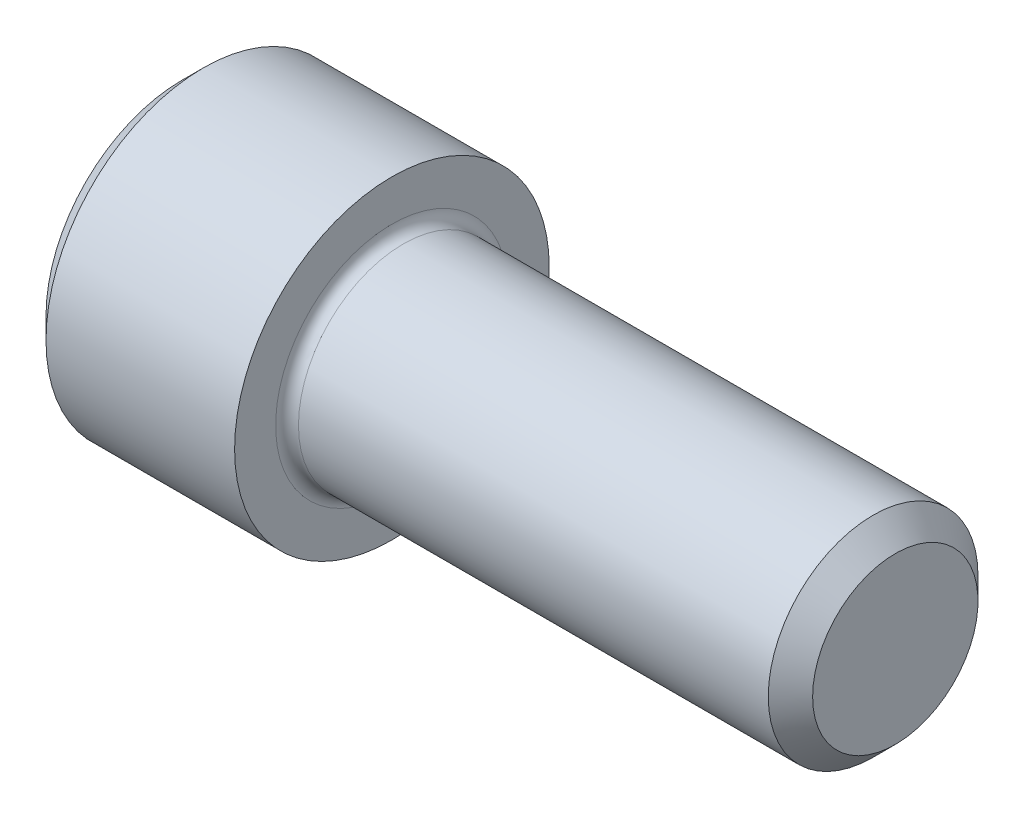
ISO-10303-21;
HEADER;
FILE_DESCRIPTION(('STEP AP214'),'2;1');
FILE_NAME('part.step','',(''),(''),'','','');
FILE_SCHEMA(('AUTOMOTIVE_DESIGN { 1 0 10303 214 1 1 1 1 }'));
ENDSEC;
DATA;
#1=APPLICATION_CONTEXT('core data for automotive mechanical design processes');
#2=APPLICATION_PROTOCOL_DEFINITION('international standard','automotive_design',2000,#1);
#3=PRODUCT_CONTEXT('',#1,'mechanical');
#4=PRODUCT('Part','Part','',(#3));
#5=PRODUCT_RELATED_PRODUCT_CATEGORY('part','',(#4));
#6=PRODUCT_DEFINITION_FORMATION('','',#4);
#7=PRODUCT_DEFINITION_CONTEXT('part definition',#1,'design');
#8=PRODUCT_DEFINITION('design','',#6,#7);
#9=PRODUCT_DEFINITION_SHAPE('','',#8);
#10=(LENGTH_UNIT() NAMED_UNIT(*) SI_UNIT(.MILLI.,.METRE.));
#11=(NAMED_UNIT(*) PLANE_ANGLE_UNIT() SI_UNIT($,.RADIAN.));
#12=(NAMED_UNIT(*) SI_UNIT($,.STERADIAN.) SOLID_ANGLE_UNIT());
#13=UNCERTAINTY_MEASURE_WITH_UNIT(LENGTH_MEASURE(1.E-05),#10,'distance_accuracy_value','');
#14=(GEOMETRIC_REPRESENTATION_CONTEXT(3) GLOBAL_UNCERTAINTY_ASSIGNED_CONTEXT((#13)) GLOBAL_UNIT_ASSIGNED_CONTEXT((#10,
#11,#12)) REPRESENTATION_CONTEXT('',''));
#15=CARTESIAN_POINT('',(0.,0.,0.));
#16=DIRECTION('',(0.,0.,1.));
#17=DIRECTION('',(1.,0.,0.));
#18=AXIS2_PLACEMENT_3D('',#15,#16,#17);
#19=CARTESIAN_POINT('',(0.,0.,0.));
#20=DIRECTION('',(-1.,0.,0.));
#21=DIRECTION('',(0.,0.,1.));
#22=AXIS2_PLACEMENT_3D('',#19,#20,#21);
#23=PLANE('',#22);
#24=DIRECTION('',(0.,-0.499999999999999,0.866025403784439));
#25=VECTOR('',#24,1.);
#26=CARTESIAN_POINT('',(0.,3.66617420935413,0.));
#27=LINE('',#26,#25);
#28=CARTESIAN_POINT('',(0.,3.66617420935413,0.));
#29=VERTEX_POINT('',#28);
#30=CARTESIAN_POINT('',(0.,1.83308710467707,3.17499999999999));
#31=VERTEX_POINT('',#30);
#32=EDGE_CURVE('E255',#29,#31,#27,.T.);
#33=ORIENTED_EDGE('',*,*,#32,.T.);
#34=DIRECTION('',(0.,1.,0.));
#35=VECTOR('',#34,1.);
#36=CARTESIAN_POINT('',(0.,-1.83308710467705,3.175));
#37=LINE('',#36,#35);
#38=CARTESIAN_POINT('',(0.,-1.83308710467705,3.175));
#39=VERTEX_POINT('',#38);
#40=EDGE_CURVE('E126',#39,#31,#37,.T.);
#41=ORIENTED_EDGE('',*,*,#40,.F.);
#42=DIRECTION('',(0.,-0.500000000000001,-0.866025403784438));
#43=VECTOR('',#42,1.);
#44=CARTESIAN_POINT('',(0.,-1.83308710467705,3.175));
#45=LINE('',#44,#43);
#46=CARTESIAN_POINT('',(0.,-3.66617420935412,0.));
#47=VERTEX_POINT('',#46);
#48=EDGE_CURVE('E258',#39,#47,#45,.T.);
#49=ORIENTED_EDGE('',*,*,#48,.T.);
#50=DIRECTION('',(0.,0.499999999999999,-0.866025403784439));
#51=VECTOR('',#50,1.);
#52=CARTESIAN_POINT('',(0.,-3.66617420935412,0.));
#53=LINE('',#52,#51);
#54=CARTESIAN_POINT('',(0.,-1.83308710467706,-3.175));
#55=VERTEX_POINT('',#54);
#56=EDGE_CURVE('E261',#47,#55,#53,.T.);
#57=ORIENTED_EDGE('',*,*,#56,.T.);
#58=DIRECTION('',(0.,-1.,0.));
#59=VECTOR('',#58,1.);
#60=CARTESIAN_POINT('',(0.,1.83308710467706,-3.175));
#61=LINE('',#60,#59);
#62=CARTESIAN_POINT('',(0.,1.83308710467706,-3.175));
#63=VERTEX_POINT('',#62);
#64=EDGE_CURVE('E264',#63,#55,#61,.T.);
#65=ORIENTED_EDGE('',*,*,#64,.F.);
#66=DIRECTION('',(0.,-0.500000000000001,-0.866025403784438));
#67=VECTOR('',#66,1.);
#68=CARTESIAN_POINT('',(0.,3.66617420935413,0.));
#69=LINE('',#68,#67);
#70=EDGE_CURVE('E121',#29,#63,#69,.T.);
#71=ORIENTED_EDGE('',*,*,#70,.F.);
#72=EDGE_LOOP('',(#33,#41,#49,#57,#65,#71));
#73=FACE_BOUND('',#72,.T.);
#74=CARTESIAN_POINT('',(0.,0.,0.));
#75=DIRECTION('',(-1.,0.,0.));
#76=DIRECTION('',(0.,0.,1.));
#77=AXIS2_PLACEMENT_3D('',#74,#75,#76);
#78=CIRCLE('',#77,5.15366);
#79=CARTESIAN_POINT('',(0.,0.,5.15366));
#80=VERTEX_POINT('',#79);
#81=EDGE_CURVE('E150',#80,#80,#78,.T.);
#82=ORIENTED_EDGE('',*,*,#81,.T.);
#83=EDGE_LOOP('',(#82));
#84=FACE_BOUND('',#83,.T.);
#85=ADVANCED_FACE('F30',(#73,#84),#23,.T.);
#86=CARTESIAN_POINT('',(0.,0.,0.));
#87=DIRECTION('',(1.,0.,0.));
#88=DIRECTION('',(0.,0.,-1.));
#89=AXIS2_PLACEMENT_3D('',#86,#87,#88);
#90=CONICAL_SURFACE('',#89,5.15366,0.78539816339745);
#91=CARTESIAN_POINT('',(0.800099999999998,0.,0.));
#92=DIRECTION('',(-1.,0.,0.));
#93=DIRECTION('',(0.,0.,1.));
#94=AXIS2_PLACEMENT_3D('',#91,#92,#93);
#95=CIRCLE('',#94,5.95376);
#96=CARTESIAN_POINT('',(0.800099999999998,0.,5.95376));
#97=VERTEX_POINT('',#96);
#98=EDGE_CURVE('E147',#97,#97,#95,.T.);
#99=ORIENTED_EDGE('',*,*,#98,.T.);
#100=EDGE_LOOP('',(#99));
#101=FACE_BOUND('',#100,.T.);
#102=ORIENTED_EDGE('',*,*,#81,.F.);
#103=EDGE_LOOP('',(#102));
#104=FACE_BOUND('',#103,.T.);
#105=ADVANCED_FACE('F171',(#101,#104),#90,.T.);
#106=CARTESIAN_POINT('',(-31.75,0.,0.));
#107=DIRECTION('',(-1.,0.,0.));
#108=DIRECTION('',(0.,0.,1.));
#109=AXIS2_PLACEMENT_3D('',#106,#107,#108);
#110=CYLINDRICAL_SURFACE('',#109,5.95376);
#111=CARTESIAN_POINT('',(7.9375,0.,0.));
#112=DIRECTION('',(-1.,0.,0.));
#113=DIRECTION('',(0.,0.,1.));
#114=AXIS2_PLACEMENT_3D('',#111,#112,#113);
#115=CIRCLE('',#114,5.95376);
#116=CARTESIAN_POINT('',(7.9375,0.,5.95376));
#117=VERTEX_POINT('',#116);
#118=EDGE_CURVE('E144',#117,#117,#115,.T.);
#119=ORIENTED_EDGE('',*,*,#118,.T.);
#120=EDGE_LOOP('',(#119));
#121=FACE_BOUND('',#120,.T.);
#122=ORIENTED_EDGE('',*,*,#98,.F.);
#123=EDGE_LOOP('',(#122));
#124=FACE_BOUND('',#123,.T.);
#125=ADVANCED_FACE('F176',(#121,#124),#110,.T.);
#126=CARTESIAN_POINT('',(7.9375,5.95376,0.));
#127=DIRECTION('',(1.,0.,0.));
#128=DIRECTION('',(0.,0.,-1.));
#129=AXIS2_PLACEMENT_3D('',#126,#127,#128);
#130=PLANE('',#129);
#131=CARTESIAN_POINT('',(7.9375,0.,0.));
#132=DIRECTION('',(1.,0.,0.));
#133=DIRECTION('',(0.,0.,-1.));
#134=AXIS2_PLACEMENT_3D('',#131,#132,#133);
#135=CIRCLE('',#134,4.40055);
#136=CARTESIAN_POINT('',(7.9375,0.,-4.40055));
#137=VERTEX_POINT('',#136);
#138=EDGE_CURVE('E38',#137,#137,#135,.F.);
#139=ORIENTED_EDGE('',*,*,#138,.T.);
#140=EDGE_LOOP('',(#139));
#141=FACE_BOUND('',#140,.T.);
#142=ORIENTED_EDGE('',*,*,#118,.F.);
#143=EDGE_LOOP('',(#142));
#144=FACE_BOUND('',#143,.T.);
#145=ADVANCED_FACE('F155',(#141,#144),#130,.T.);
#146=CARTESIAN_POINT('',(-31.75,0.,0.));
#147=DIRECTION('',(-1.,0.,0.));
#148=DIRECTION('',(0.,0.,1.));
#149=AXIS2_PLACEMENT_3D('',#146,#147,#148);
#150=CYLINDRICAL_SURFACE('',#149,3.96875);
#151=CARTESIAN_POINT('',(8.3693,0.,0.));
#152=DIRECTION('',(1.,0.,0.));
#153=DIRECTION('',(0.,0.,-1.));
#154=AXIS2_PLACEMENT_3D('',#151,#152,#153);
#155=CIRCLE('',#154,3.96875);
#156=CARTESIAN_POINT('',(8.3693,0.,-3.96875));
#157=VERTEX_POINT('',#156);
#158=EDGE_CURVE('E11',#157,#157,#155,.T.);
#159=ORIENTED_EDGE('',*,*,#158,.T.);
#160=EDGE_LOOP('',(#159));
#161=FACE_BOUND('',#160,.T.);
#162=CARTESIAN_POINT('',(26.14803,0.,0.));
#163=DIRECTION('',(-1.,0.,0.));
#164=DIRECTION('',(0.,0.,1.));
#165=AXIS2_PLACEMENT_3D('',#162,#163,#164);
#166=CIRCLE('',#165,3.96875);
#167=CARTESIAN_POINT('',(26.14803,0.,3.96875));
#168=VERTEX_POINT('',#167);
#169=EDGE_CURVE('E141',#168,#168,#166,.T.);
#170=ORIENTED_EDGE('',*,*,#169,.T.);
#171=EDGE_LOOP('',(#170));
#172=FACE_BOUND('',#171,.T.);
#173=ADVANCED_FACE('F186',(#161,#172),#150,.T.);
#174=CARTESIAN_POINT('',(26.9875,0.,0.));
#175=DIRECTION('',(-1.,0.,0.));
#176=DIRECTION('',(0.,0.,1.));
#177=AXIS2_PLACEMENT_3D('',#174,#175,#176);
#178=CONICAL_SURFACE('',#177,3.12928,0.785398163397459);
#179=ORIENTED_EDGE('',*,*,#169,.F.);
#180=EDGE_LOOP('',(#179));
#181=FACE_BOUND('',#180,.T.);
#182=CARTESIAN_POINT('',(26.9875,0.,0.));
#183=DIRECTION('',(-1.,0.,0.));
#184=DIRECTION('',(0.,0.,1.));
#185=AXIS2_PLACEMENT_3D('',#182,#183,#184);
#186=CIRCLE('',#185,3.12928);
#187=CARTESIAN_POINT('',(26.9875,0.,3.12928));
#188=VERTEX_POINT('',#187);
#189=EDGE_CURVE('E137',#188,#188,#186,.T.);
#190=ORIENTED_EDGE('',*,*,#189,.T.);
#191=EDGE_LOOP('',(#190));
#192=FACE_BOUND('',#191,.T.);
#193=ADVANCED_FACE('F166',(#181,#192),#178,.T.);
#194=CARTESIAN_POINT('',(26.9875,3.12928,0.));
#195=DIRECTION('',(1.,0.,0.));
#196=DIRECTION('',(0.,0.,-1.));
#197=AXIS2_PLACEMENT_3D('',#194,#195,#196);
#198=PLANE('',#197);
#199=ORIENTED_EDGE('',*,*,#189,.F.);
#200=EDGE_LOOP('',(#199));
#201=FACE_BOUND('',#200,.T.);
#202=ADVANCED_FACE('F159',(#201),#198,.T.);
#203=CARTESIAN_POINT('',(8.3693,0.,0.));
#204=DIRECTION('',(1.,0.,0.));
#205=DIRECTION('',(0.,0.,-1.));
#206=AXIS2_PLACEMENT_3D('',#203,#204,#205);
#207=TOROIDAL_SURFACE('',#206,4.40055,0.4318);
#208=ORIENTED_EDGE('',*,*,#158,.F.);
#209=EDGE_LOOP('',(#208));
#210=FACE_BOUND('',#209,.T.);
#211=ORIENTED_EDGE('',*,*,#138,.F.);
#212=EDGE_LOOP('',(#211));
#213=FACE_BOUND('',#212,.T.);
#214=ADVANCED_FACE('F32',(#210,#213),#207,.F.);
#215=CARTESIAN_POINT('',(3.8354,3.66617420935413,0.));
#216=DIRECTION('',(0.,-0.866025403784439,-0.499999999999999));
#217=DIRECTION('',(0.,0.499999999999999,-0.866025403784439));
#218=AXIS2_PLACEMENT_3D('',#215,#216,#217);
#219=PLANE('',#218);
#220=ORIENTED_EDGE('',*,*,#32,.F.);
#221=DIRECTION('',(-1.,0.,0.));
#222=VECTOR('',#221,1.);
#223=CARTESIAN_POINT('',(3.8354,3.66617420935413,0.));
#224=LINE('',#223,#222);
#225=CARTESIAN_POINT('',(3.8354,3.66617420935413,0.));
#226=VERTEX_POINT('',#225);
#227=EDGE_CURVE('E245',#226,#29,#224,.T.);
#228=ORIENTED_EDGE('',*,*,#227,.F.);
#229=DIRECTION('',(0.,-0.499999999999999,0.866025403784439));
#230=VECTOR('',#229,1.);
#231=CARTESIAN_POINT('',(3.8354,3.66617420935413,0.));
#232=LINE('',#231,#230);
#233=CARTESIAN_POINT('',(3.8354,2.7496306570156,1.5875));
#234=VERTEX_POINT('',#233);
#235=EDGE_CURVE('E113',#226,#234,#232,.T.);
#236=ORIENTED_EDGE('',*,*,#235,.T.);
#237=CARTESIAN_POINT('',(3.8354,1.83308710467707,3.17499999999999));
#238=VERTEX_POINT('',#237);
#239=EDGE_CURVE('E104',#234,#238,#232,.T.);
#240=ORIENTED_EDGE('',*,*,#239,.T.);
#241=DIRECTION('',(-1.,0.,0.));
#242=VECTOR('',#241,1.);
#243=CARTESIAN_POINT('',(3.8354,1.83308710467707,3.17499999999999));
#244=LINE('',#243,#242);
#245=EDGE_CURVE('E118',#238,#31,#244,.T.);
#246=ORIENTED_EDGE('',*,*,#245,.T.);
#247=EDGE_LOOP('',(#220,#228,#236,#240,#246));
#248=FACE_BOUND('',#247,.T.);
#249=ADVANCED_FACE('F117',(#248),#219,.T.);
#250=CARTESIAN_POINT('',(3.8354,-1.83308710467705,3.175));
#251=DIRECTION('',(0.,0.,1.));
#252=DIRECTION('',(0.,-1.,0.));
#253=AXIS2_PLACEMENT_3D('',#250,#251,#252);
#254=PLANE('',#253);
#255=ORIENTED_EDGE('',*,*,#40,.T.);
#256=ORIENTED_EDGE('',*,*,#245,.F.);
#257=DIRECTION('',(0.,1.,0.));
#258=VECTOR('',#257,1.);
#259=CARTESIAN_POINT('',(3.8354,-1.83308710467705,3.175));
#260=LINE('',#259,#258);
#261=CARTESIAN_POINT('',(3.8354,0.,3.175));
#262=VERTEX_POINT('',#261);
#263=EDGE_CURVE('E101',#262,#238,#260,.T.);
#264=ORIENTED_EDGE('',*,*,#263,.F.);
#265=CARTESIAN_POINT('',(3.8354,-1.83308710467705,3.175));
#266=VERTEX_POINT('',#265);
#267=EDGE_CURVE('E112',#266,#262,#260,.T.);
#268=ORIENTED_EDGE('',*,*,#267,.F.);
#269=DIRECTION('',(-1.,0.,0.));
#270=VECTOR('',#269,1.);
#271=CARTESIAN_POINT('',(3.8354,-1.83308710467705,3.175));
#272=LINE('',#271,#270);
#273=EDGE_CURVE('E128',#266,#39,#272,.T.);
#274=ORIENTED_EDGE('',*,*,#273,.T.);
#275=EDGE_LOOP('',(#255,#256,#264,#268,#274));
#276=FACE_BOUND('',#275,.T.);
#277=ADVANCED_FACE('F123',(#276),#254,.F.);
#278=CARTESIAN_POINT('',(3.8354,-1.83308710467705,3.175));
#279=DIRECTION('',(0.,0.866025403784438,-0.500000000000001));
#280=DIRECTION('',(0.,0.500000000000001,0.866025403784438));
#281=AXIS2_PLACEMENT_3D('',#278,#279,#280);
#282=PLANE('',#281);
#283=ORIENTED_EDGE('',*,*,#48,.F.);
#284=ORIENTED_EDGE('',*,*,#273,.F.);
#285=DIRECTION('',(0.,-0.500000000000001,-0.866025403784438));
#286=VECTOR('',#285,1.);
#287=CARTESIAN_POINT('',(3.8354,-1.83308710467705,3.175));
#288=LINE('',#287,#286);
#289=CARTESIAN_POINT('',(3.8354,-2.74963065701559,1.5875));
#290=VERTEX_POINT('',#289);
#291=EDGE_CURVE('E284',#266,#290,#288,.T.);
#292=ORIENTED_EDGE('',*,*,#291,.T.);
#293=CARTESIAN_POINT('',(3.8354,-3.66617420935412,0.));
#294=VERTEX_POINT('',#293);
#295=EDGE_CURVE('E273',#290,#294,#288,.T.);
#296=ORIENTED_EDGE('',*,*,#295,.T.);
#297=DIRECTION('',(-1.,0.,0.));
#298=VECTOR('',#297,1.);
#299=CARTESIAN_POINT('',(3.8354,-3.66617420935412,0.));
#300=LINE('',#299,#298);
#301=EDGE_CURVE('E133',#294,#47,#300,.T.);
#302=ORIENTED_EDGE('',*,*,#301,.T.);
#303=EDGE_LOOP('',(#283,#284,#292,#296,#302));
#304=FACE_BOUND('',#303,.T.);
#305=ADVANCED_FACE('F199',(#304),#282,.T.);
#306=CARTESIAN_POINT('',(3.8354,-3.66617420935412,0.));
#307=DIRECTION('',(0.,0.86602540378444,0.499999999999999));
#308=DIRECTION('',(0.,-0.499999999999999,0.866025403784439));
#309=AXIS2_PLACEMENT_3D('',#306,#307,#308);
#310=PLANE('',#309);
#311=ORIENTED_EDGE('',*,*,#56,.F.);
#312=ORIENTED_EDGE('',*,*,#301,.F.);
#313=DIRECTION('',(0.,0.499999999999999,-0.866025403784439));
#314=VECTOR('',#313,1.);
#315=CARTESIAN_POINT('',(3.8354,-3.66617420935412,0.));
#316=LINE('',#315,#314);
#317=CARTESIAN_POINT('',(3.8354,-2.74963065701559,-1.58749999999999));
#318=VERTEX_POINT('',#317);
#319=EDGE_CURVE('E251',#294,#318,#316,.T.);
#320=ORIENTED_EDGE('',*,*,#319,.T.);
#321=CARTESIAN_POINT('',(3.8354,-1.83308710467706,-3.175));
#322=VERTEX_POINT('',#321);
#323=EDGE_CURVE('E283',#318,#322,#316,.T.);
#324=ORIENTED_EDGE('',*,*,#323,.T.);
#325=DIRECTION('',(-1.,0.,0.));
#326=VECTOR('',#325,1.);
#327=CARTESIAN_POINT('',(3.8354,-1.83308710467706,-3.175));
#328=LINE('',#327,#326);
#329=EDGE_CURVE('E244',#322,#55,#328,.T.);
#330=ORIENTED_EDGE('',*,*,#329,.T.);
#331=EDGE_LOOP('',(#311,#312,#320,#324,#330));
#332=FACE_BOUND('',#331,.T.);
#333=ADVANCED_FACE('F202',(#332),#310,.T.);
#334=CARTESIAN_POINT('',(3.8354,1.83308710467706,-3.175));
#335=DIRECTION('',(0.,0.,-1.));
#336=DIRECTION('',(0.,1.,0.));
#337=AXIS2_PLACEMENT_3D('',#334,#335,#336);
#338=PLANE('',#337);
#339=ORIENTED_EDGE('',*,*,#64,.T.);
#340=ORIENTED_EDGE('',*,*,#329,.F.);
#341=DIRECTION('',(0.,-1.,0.));
#342=VECTOR('',#341,1.);
#343=CARTESIAN_POINT('',(3.8354,1.83308710467706,-3.175));
#344=LINE('',#343,#342);
#345=CARTESIAN_POINT('',(3.8354,0.,-3.175));
#346=VERTEX_POINT('',#345);
#347=EDGE_CURVE('E248',#346,#322,#344,.T.);
#348=ORIENTED_EDGE('',*,*,#347,.F.);
#349=CARTESIAN_POINT('',(3.8354,1.83308710467706,-3.175));
#350=VERTEX_POINT('',#349);
#351=EDGE_CURVE('E45',#350,#346,#344,.T.);
#352=ORIENTED_EDGE('',*,*,#351,.F.);
#353=DIRECTION('',(-1.,0.,0.));
#354=VECTOR('',#353,1.);
#355=CARTESIAN_POINT('',(3.8354,1.83308710467706,-3.175));
#356=LINE('',#355,#354);
#357=EDGE_CURVE('E241',#350,#63,#356,.T.);
#358=ORIENTED_EDGE('',*,*,#357,.T.);
#359=EDGE_LOOP('',(#339,#340,#348,#352,#358));
#360=FACE_BOUND('',#359,.T.);
#361=ADVANCED_FACE('F206',(#360),#338,.F.);
#362=CARTESIAN_POINT('',(3.8354,3.66617420935413,0.));
#363=DIRECTION('',(0.,0.866025403784438,-0.500000000000001));
#364=DIRECTION('',(0.,0.500000000000001,0.866025403784438));
#365=AXIS2_PLACEMENT_3D('',#362,#363,#364);
#366=PLANE('',#365);
#367=ORIENTED_EDGE('',*,*,#70,.T.);
#368=ORIENTED_EDGE('',*,*,#357,.F.);
#369=DIRECTION('',(0.,-0.500000000000001,-0.866025403784438));
#370=VECTOR('',#369,1.);
#371=CARTESIAN_POINT('',(3.8354,3.66617420935413,0.));
#372=LINE('',#371,#370);
#373=CARTESIAN_POINT('',(3.8354,2.74963065701559,-1.58750000000001));
#374=VERTEX_POINT('',#373);
#375=EDGE_CURVE('E231',#374,#350,#372,.T.);
#376=ORIENTED_EDGE('',*,*,#375,.F.);
#377=EDGE_CURVE('E237',#226,#374,#372,.T.);
#378=ORIENTED_EDGE('',*,*,#377,.F.);
#379=ORIENTED_EDGE('',*,*,#227,.T.);
#380=EDGE_LOOP('',(#367,#368,#376,#378,#379));
#381=FACE_BOUND('',#380,.T.);
#382=ADVANCED_FACE('F210',(#381),#366,.F.);
#383=CARTESIAN_POINT('',(3.8354,3.66617420935413,0.));
#384=DIRECTION('',(1.,0.,0.));
#385=DIRECTION('',(0.,0.,-1.));
#386=AXIS2_PLACEMENT_3D('',#383,#384,#385);
#387=PLANE('',#386);
#388=ORIENTED_EDGE('',*,*,#347,.T.);
#389=ORIENTED_EDGE('',*,*,#323,.F.);
#390=CARTESIAN_POINT('',(3.8354,0.,0.));
#391=DIRECTION('',(-1.,0.,0.));
#392=DIRECTION('',(0.,0.,1.));
#393=AXIS2_PLACEMENT_3D('',#390,#391,#392);
#394=CIRCLE('',#393,3.175);
#395=EDGE_CURVE('E279',#346,#318,#394,.T.);
#396=ORIENTED_EDGE('',*,*,#395,.F.);
#397=EDGE_LOOP('',(#388,#389,#396));
#398=FACE_BOUND('',#397,.T.);
#399=ADVANCED_FACE('F214',(#398),#387,.F.);
#400=ORIENTED_EDGE('',*,*,#319,.F.);
#401=ORIENTED_EDGE('',*,*,#295,.F.);
#402=EDGE_CURVE('E131',#318,#290,#394,.T.);
#403=ORIENTED_EDGE('',*,*,#402,.F.);
#404=EDGE_LOOP('',(#400,#401,#403));
#405=FACE_BOUND('',#404,.T.);
#406=ADVANCED_FACE('F217',(#405),#387,.F.);
#407=ORIENTED_EDGE('',*,*,#291,.F.);
#408=ORIENTED_EDGE('',*,*,#267,.T.);
#409=EDGE_CURVE('E127',#290,#262,#394,.T.);
#410=ORIENTED_EDGE('',*,*,#409,.F.);
#411=EDGE_LOOP('',(#407,#408,#410));
#412=FACE_BOUND('',#411,.T.);
#413=ADVANCED_FACE('F222',(#412),#387,.F.);
#414=ORIENTED_EDGE('',*,*,#263,.T.);
#415=ORIENTED_EDGE('',*,*,#239,.F.);
#416=EDGE_CURVE('E107',#262,#234,#394,.T.);
#417=ORIENTED_EDGE('',*,*,#416,.F.);
#418=EDGE_LOOP('',(#414,#415,#417));
#419=FACE_BOUND('',#418,.T.);
#420=ADVANCED_FACE('F103',(#419),#387,.F.);
#421=ORIENTED_EDGE('',*,*,#235,.F.);
#422=ORIENTED_EDGE('',*,*,#377,.T.);
#423=EDGE_CURVE('E138',#234,#374,#394,.T.);
#424=ORIENTED_EDGE('',*,*,#423,.F.);
#425=EDGE_LOOP('',(#421,#422,#424));
#426=FACE_BOUND('',#425,.T.);
#427=ADVANCED_FACE('F225',(#426),#387,.F.);
#428=ORIENTED_EDGE('',*,*,#375,.T.);
#429=ORIENTED_EDGE('',*,*,#351,.T.);
#430=EDGE_CURVE('E234',#374,#346,#394,.T.);
#431=ORIENTED_EDGE('',*,*,#430,.F.);
#432=EDGE_LOOP('',(#428,#429,#431));
#433=FACE_BOUND('',#432,.T.);
#434=ADVANCED_FACE('F195',(#433),#387,.F.);
#435=CARTESIAN_POINT('',(3.8354,0.,0.));
#436=DIRECTION('',(-1.,0.,0.));
#437=DIRECTION('',(0.,0.,1.));
#438=AXIS2_PLACEMENT_3D('',#435,#436,#437);
#439=CONICAL_SURFACE('',#438,3.175,1.04719755119659);
#440=CARTESIAN_POINT('',(5.66848710467709,0.,0.));
#441=VERTEX_POINT('',#440);
#442=VERTEX_LOOP('',#441);
#443=FACE_BOUND('',#442,.T.);
#444=ORIENTED_EDGE('',*,*,#416,.T.);
#445=ORIENTED_EDGE('',*,*,#423,.T.);
#446=ORIENTED_EDGE('',*,*,#430,.T.);
#447=ORIENTED_EDGE('',*,*,#395,.T.);
#448=ORIENTED_EDGE('',*,*,#402,.T.);
#449=ORIENTED_EDGE('',*,*,#409,.T.);
#450=EDGE_LOOP('',(#444,#445,#446,#447,#448,#449));
#451=FACE_BOUND('',#450,.T.);
#452=ADVANCED_FACE('F193',(#443,#451),#439,.F.);
#453=CLOSED_SHELL('',(#85,#105,#125,#145,#173,#193,#202,#214,#249,#277,#305,#333,#361,#382,#399,
#406,#413,#420,#427,#434,#452));
#454=MANIFOLD_SOLID_BREP('B2',#453);
#455=ADVANCED_BREP_SHAPE_REPRESENTATION('',(#18,#454),#14);
#456=SHAPE_DEFINITION_REPRESENTATION(#9,#455);
ENDSEC;
END-ISO-10303-21;
